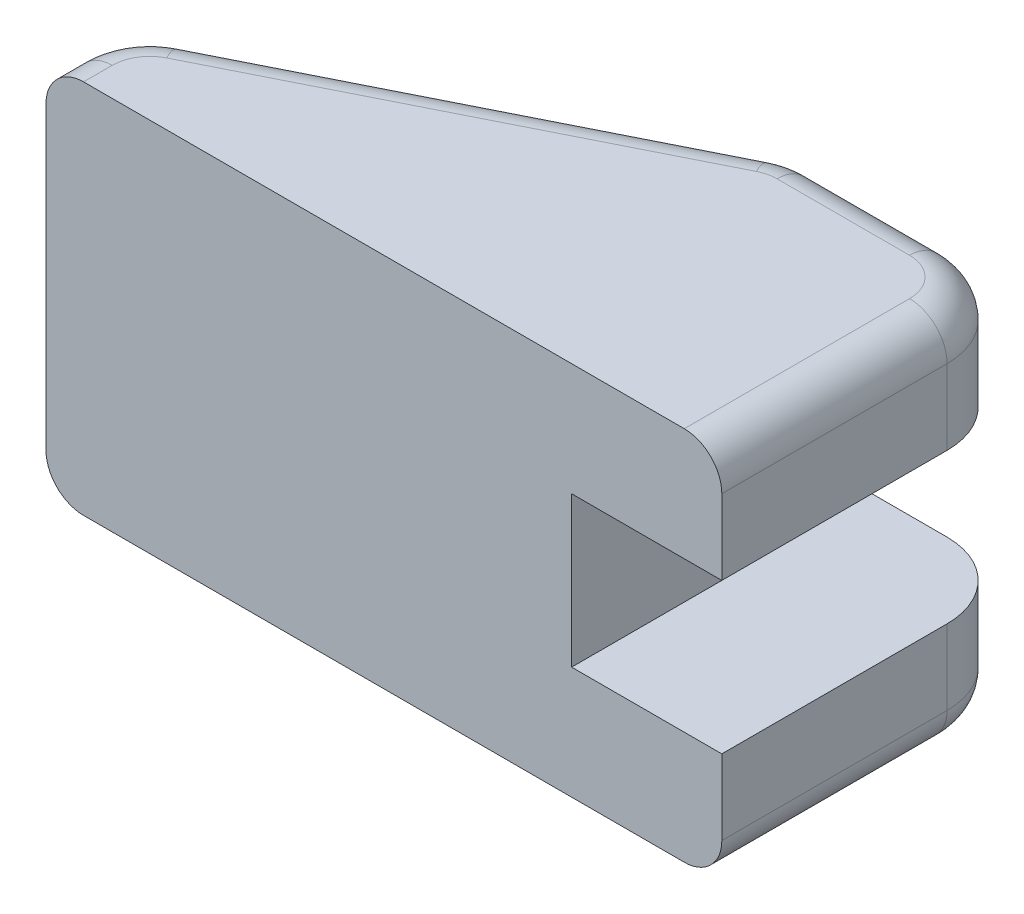
ISO-10303-21;
HEADER;
FILE_DESCRIPTION(('STEP AP214'),'2;1');
FILE_NAME('part.step','',(''),(''),'','','');
FILE_SCHEMA(('AUTOMOTIVE_DESIGN { 1 0 10303 214 1 1 1 1 }'));
ENDSEC;
DATA;
#1=APPLICATION_CONTEXT('core data for automotive mechanical design processes');
#2=APPLICATION_PROTOCOL_DEFINITION('international standard','automotive_design',2000,#1);
#3=PRODUCT_CONTEXT('',#1,'mechanical');
#4=PRODUCT('Part','Part','',(#3));
#5=PRODUCT_RELATED_PRODUCT_CATEGORY('part','',(#4));
#6=PRODUCT_DEFINITION_FORMATION('','',#4);
#7=PRODUCT_DEFINITION_CONTEXT('part definition',#1,'design');
#8=PRODUCT_DEFINITION('design','',#6,#7);
#9=PRODUCT_DEFINITION_SHAPE('','',#8);
#10=(LENGTH_UNIT() NAMED_UNIT(*) SI_UNIT(.MILLI.,.METRE.));
#11=(NAMED_UNIT(*) PLANE_ANGLE_UNIT() SI_UNIT($,.RADIAN.));
#12=(NAMED_UNIT(*) SI_UNIT($,.STERADIAN.) SOLID_ANGLE_UNIT());
#13=UNCERTAINTY_MEASURE_WITH_UNIT(LENGTH_MEASURE(1.E-05),#10,'distance_accuracy_value','');
#14=(GEOMETRIC_REPRESENTATION_CONTEXT(3) GLOBAL_UNCERTAINTY_ASSIGNED_CONTEXT((#13)) GLOBAL_UNIT_ASSIGNED_CONTEXT((#10,
#11,#12)) REPRESENTATION_CONTEXT('',''));
#15=CARTESIAN_POINT('',(0.,0.,0.));
#16=DIRECTION('',(0.,0.,1.));
#17=DIRECTION('',(1.,0.,0.));
#18=AXIS2_PLACEMENT_3D('',#15,#16,#17);
#19=CARTESIAN_POINT('',(-652.,0.,-40.));
#20=DIRECTION('',(-1.,0.,0.));
#21=DIRECTION('',(0.,0.,1.));
#22=AXIS2_PLACEMENT_3D('',#19,#20,#21);
#23=PLANE('',#22);
#24=DIRECTION('',(0.,-1.,0.));
#25=VECTOR('',#24,1.);
#26=CARTESIAN_POINT('',(-652.,0.,-3.81966011250102));
#27=LINE('',#26,#25);
#28=CARTESIAN_POINT('',(-652.,420.,-3.81966011250102));
#29=VERTEX_POINT('',#28);
#30=CARTESIAN_POINT('',(-652.,380.,-3.81966011250102));
#31=VERTEX_POINT('',#30);
#32=EDGE_CURVE('E251',#29,#31,#27,.T.);
#33=ORIENTED_EDGE('',*,*,#32,.T.);
#34=DIRECTION('',(0.,0.,1.));
#35=VECTOR('',#34,1.);
#36=CARTESIAN_POINT('',(-652.,380.,0.));
#37=LINE('',#36,#35);
#38=CARTESIAN_POINT('',(-652.,380.,0.));
#39=VERTEX_POINT('',#38);
#40=EDGE_CURVE('E267',#31,#39,#37,.T.);
#41=ORIENTED_EDGE('',*,*,#40,.T.);
#42=DIRECTION('',(0.,-1.,0.));
#43=VECTOR('',#42,1.);
#44=CARTESIAN_POINT('',(-652.,0.,0.));
#45=LINE('',#44,#43);
#46=CARTESIAN_POINT('',(-652.,420.,0.));
#47=VERTEX_POINT('',#46);
#48=EDGE_CURVE('E216',#47,#39,#45,.T.);
#49=ORIENTED_EDGE('',*,*,#48,.F.);
#50=DIRECTION('',(0.,0.,1.));
#51=VECTOR('',#50,1.);
#52=CARTESIAN_POINT('',(-652.,420.,-40.));
#53=LINE('',#52,#51);
#54=EDGE_CURVE('E265',#47,#29,#53,.F.);
#55=ORIENTED_EDGE('',*,*,#54,.T.);
#56=EDGE_LOOP('',(#33,#41,#49,#55));
#57=FACE_BOUND('',#56,.T.);
#58=ADVANCED_FACE('F42',(#57),#23,.T.);
#59=CARTESIAN_POINT('',(0.,425.,-40.));
#60=DIRECTION('',(0.,1.,0.));
#61=DIRECTION('',(0.,0.,1.));
#62=AXIS2_PLACEMENT_3D('',#59,#60,#61);
#63=PLANE('',#62);
#64=DIRECTION('',(-1.,0.,0.));
#65=VECTOR('',#64,1.);
#66=CARTESIAN_POINT('',(0.,425.,0.));
#67=LINE('',#66,#65);
#68=CARTESIAN_POINT('',(-567.,425.,0.));
#69=VERTEX_POINT('',#68);
#70=CARTESIAN_POINT('',(-647.,425.,0.));
#71=VERTEX_POINT('',#70);
#72=EDGE_CURVE('E207',#69,#71,#67,.T.);
#73=ORIENTED_EDGE('',*,*,#72,.F.);
#74=DIRECTION('',(0.,0.,1.));
#75=VECTOR('',#74,1.);
#76=CARTESIAN_POINT('',(-567.,425.,-40.));
#77=LINE('',#76,#75);
#78=CARTESIAN_POINT('',(-567.,425.,-30.));
#79=VERTEX_POINT('',#78);
#80=EDGE_CURVE('E59',#69,#79,#77,.F.);
#81=ORIENTED_EDGE('',*,*,#80,.T.);
#82=CARTESIAN_POINT('',(-572.,425.,-30.));
#83=DIRECTION('',(0.,1.,0.));
#84=DIRECTION('',(0.,0.,1.));
#85=AXIS2_PLACEMENT_3D('',#82,#83,#84);
#86=CIRCLE('',#85,5.);
#87=CARTESIAN_POINT('',(-572.,425.,-35.));
#88=VERTEX_POINT('',#87);
#89=EDGE_CURVE('E63',#79,#88,#86,.T.);
#90=ORIENTED_EDGE('',*,*,#89,.T.);
#91=DIRECTION('',(-1.,0.,0.));
#92=VECTOR('',#91,1.);
#93=CARTESIAN_POINT('',(-589.639320225002,425.,-35.));
#94=LINE('',#93,#92);
#95=CARTESIAN_POINT('',(-589.639320225002,425.,-35.));
#96=VERTEX_POINT('',#95);
#97=EDGE_CURVE('E319',#88,#96,#94,.T.);
#98=ORIENTED_EDGE('',*,*,#97,.T.);
#99=CARTESIAN_POINT('',(-589.639320225002,425.,-30.));
#100=DIRECTION('',(0.,1.,0.));
#101=DIRECTION('',(0.,0.,1.));
#102=AXIS2_PLACEMENT_3D('',#99,#100,#101);
#103=CIRCLE('',#102,5.);
#104=CARTESIAN_POINT('',(-591.875388202502,425.,-34.4721359549996));
#105=VERTEX_POINT('',#104);
#106=EDGE_CURVE('E317',#96,#105,#103,.T.);
#107=ORIENTED_EDGE('',*,*,#106,.T.);
#108=DIRECTION('',(-0.894427190999917,0.,0.447213595499956));
#109=VECTOR('',#108,1.);
#110=CARTESIAN_POINT('',(-116.163932022499,425.,-272.327864045));
#111=LINE('',#110,#109);
#112=CARTESIAN_POINT('',(-644.2360679775,425.,-8.29179606750059));
#113=VERTEX_POINT('',#112);
#114=EDGE_CURVE('E311',#105,#113,#111,.T.);
#115=ORIENTED_EDGE('',*,*,#114,.T.);
#116=CARTESIAN_POINT('',(-642.,425.,-3.81966011250102));
#117=DIRECTION('',(0.,1.,0.));
#118=DIRECTION('',(0.,0.,1.));
#119=AXIS2_PLACEMENT_3D('',#116,#117,#118);
#120=CIRCLE('',#119,5.);
#121=CARTESIAN_POINT('',(-647.,425.,-3.81966011250102));
#122=VERTEX_POINT('',#121);
#123=EDGE_CURVE('E313',#113,#122,#120,.T.);
#124=ORIENTED_EDGE('',*,*,#123,.T.);
#125=DIRECTION('',(0.,0.,1.));
#126=VECTOR('',#125,1.);
#127=CARTESIAN_POINT('',(-647.,425.,-40.));
#128=LINE('',#127,#126);
#129=EDGE_CURVE('E315',#122,#71,#128,.T.);
#130=ORIENTED_EDGE('',*,*,#129,.T.);
#131=EDGE_LOOP('',(#73,#81,#90,#98,#107,#115,#124,#130));
#132=FACE_BOUND('',#131,.T.);
#133=ADVANCED_FACE('F370',(#132),#63,.T.);
#134=CARTESIAN_POINT('',(-562.,0.,-40.));
#135=DIRECTION('',(1.,0.,0.));
#136=DIRECTION('',(0.,0.,-1.));
#137=AXIS2_PLACEMENT_3D('',#134,#135,#136);
#138=PLANE('',#137);
#139=DIRECTION('',(0.,1.,0.));
#140=VECTOR('',#139,1.);
#141=CARTESIAN_POINT('',(-562.,425.,-30.));
#142=LINE('',#141,#140);
#143=CARTESIAN_POINT('',(-562.,410.,-30.));
#144=VERTEX_POINT('',#143);
#145=CARTESIAN_POINT('',(-562.,420.,-30.));
#146=VERTEX_POINT('',#145);
#147=EDGE_CURVE('E260',#144,#146,#142,.T.);
#148=ORIENTED_EDGE('',*,*,#147,.T.);
#149=DIRECTION('',(0.,0.,1.));
#150=VECTOR('',#149,1.);
#151=CARTESIAN_POINT('',(-562.,420.,-40.));
#152=LINE('',#151,#150);
#153=CARTESIAN_POINT('',(-562.,420.,0.));
#154=VERTEX_POINT('',#153);
#155=EDGE_CURVE('E308',#146,#154,#152,.T.);
#156=ORIENTED_EDGE('',*,*,#155,.T.);
#157=DIRECTION('',(0.,1.,0.));
#158=VECTOR('',#157,1.);
#159=CARTESIAN_POINT('',(-562.,0.,0.));
#160=LINE('',#159,#158);
#161=CARTESIAN_POINT('',(-562.,410.,0.));
#162=VERTEX_POINT('',#161);
#163=EDGE_CURVE('E232',#162,#154,#160,.T.);
#164=ORIENTED_EDGE('',*,*,#163,.F.);
#165=DIRECTION('',(0.,0.,1.));
#166=VECTOR('',#165,1.);
#167=CARTESIAN_POINT('',(-562.,410.,-40.));
#168=LINE('',#167,#166);
#169=EDGE_CURVE('E237',#144,#162,#168,.T.);
#170=ORIENTED_EDGE('',*,*,#169,.F.);
#171=EDGE_LOOP('',(#148,#156,#164,#170));
#172=FACE_BOUND('',#171,.T.);
#173=ADVANCED_FACE('F379',(#172),#138,.T.);
#174=CARTESIAN_POINT('',(0.,410.,-40.));
#175=DIRECTION('',(0.,-1.,0.));
#176=DIRECTION('',(0.,0.,-1.));
#177=AXIS2_PLACEMENT_3D('',#174,#175,#176);
#178=PLANE('',#177);
#179=DIRECTION('',(1.,0.,0.));
#180=VECTOR('',#179,1.);
#181=CARTESIAN_POINT('',(0.,410.,-40.));
#182=LINE('',#181,#180);
#183=CARTESIAN_POINT('',(-582.,410.,-40.));
#184=VERTEX_POINT('',#183);
#185=CARTESIAN_POINT('',(-572.,410.,-40.));
#186=VERTEX_POINT('',#185);
#187=EDGE_CURVE('E212',#184,#186,#182,.T.);
#188=ORIENTED_EDGE('',*,*,#187,.T.);
#189=CARTESIAN_POINT('',(-572.,410.,-30.));
#190=DIRECTION('',(0.,-1.,0.));
#191=DIRECTION('',(0.,0.,-1.));
#192=AXIS2_PLACEMENT_3D('',#189,#190,#191);
#193=CIRCLE('',#192,10.);
#194=EDGE_CURVE('E263',#186,#144,#193,.T.);
#195=ORIENTED_EDGE('',*,*,#194,.T.);
#196=ORIENTED_EDGE('',*,*,#169,.T.);
#197=DIRECTION('',(1.,0.,0.));
#198=VECTOR('',#197,1.);
#199=CARTESIAN_POINT('',(0.,410.,0.));
#200=LINE('',#199,#198);
#201=CARTESIAN_POINT('',(-582.,410.,0.));
#202=VERTEX_POINT('',#201);
#203=EDGE_CURVE('E229',#202,#162,#200,.T.);
#204=ORIENTED_EDGE('',*,*,#203,.F.);
#205=DIRECTION('',(0.,0.,1.));
#206=VECTOR('',#205,1.);
#207=CARTESIAN_POINT('',(-582.,410.,-40.));
#208=LINE('',#207,#206);
#209=EDGE_CURVE('E195',#184,#202,#208,.T.);
#210=ORIENTED_EDGE('',*,*,#209,.F.);
#211=EDGE_LOOP('',(#188,#195,#196,#204,#210));
#212=FACE_BOUND('',#211,.T.);
#213=ADVANCED_FACE('F599',(#212),#178,.T.);
#214=CARTESIAN_POINT('',(-582.,0.,-40.));
#215=DIRECTION('',(1.,0.,0.));
#216=DIRECTION('',(0.,0.,-1.));
#217=AXIS2_PLACEMENT_3D('',#214,#215,#216);
#218=PLANE('',#217);
#219=DIRECTION('',(0.,1.,0.));
#220=VECTOR('',#219,1.);
#221=CARTESIAN_POINT('',(-582.,0.,0.));
#222=LINE('',#221,#220);
#223=CARTESIAN_POINT('',(-582.,390.,0.));
#224=VERTEX_POINT('',#223);
#225=EDGE_CURVE('E191',#224,#202,#222,.T.);
#226=ORIENTED_EDGE('',*,*,#225,.F.);
#227=DIRECTION('',(0.,0.,1.));
#228=VECTOR('',#227,1.);
#229=CARTESIAN_POINT('',(-582.,390.,-40.));
#230=LINE('',#229,#228);
#231=CARTESIAN_POINT('',(-582.,390.,-40.));
#232=VERTEX_POINT('',#231);
#233=EDGE_CURVE('E185',#232,#224,#230,.T.);
#234=ORIENTED_EDGE('',*,*,#233,.F.);
#235=DIRECTION('',(0.,1.,0.));
#236=VECTOR('',#235,1.);
#237=CARTESIAN_POINT('',(-582.,0.,-40.));
#238=LINE('',#237,#236);
#239=EDGE_CURVE('E189',#232,#184,#238,.T.);
#240=ORIENTED_EDGE('',*,*,#239,.T.);
#241=ORIENTED_EDGE('',*,*,#209,.T.);
#242=EDGE_LOOP('',(#226,#234,#240,#241));
#243=FACE_BOUND('',#242,.T.);
#244=ADVANCED_FACE('F187',(#243),#218,.T.);
#245=CARTESIAN_POINT('',(0.,390.,-40.));
#246=DIRECTION('',(0.,-1.,0.));
#247=DIRECTION('',(0.,0.,-1.));
#248=AXIS2_PLACEMENT_3D('',#245,#246,#247);
#249=PLANE('',#248);
#250=DIRECTION('',(0.,0.,1.));
#251=VECTOR('',#250,1.);
#252=CARTESIAN_POINT('',(-562.,390.,-40.));
#253=LINE('',#252,#251);
#254=CARTESIAN_POINT('',(-562.,390.,-30.));
#255=VERTEX_POINT('',#254);
#256=CARTESIAN_POINT('',(-562.,390.,0.));
#257=VERTEX_POINT('',#256);
#258=EDGE_CURVE('E196',#255,#257,#253,.T.);
#259=ORIENTED_EDGE('',*,*,#258,.F.);
#260=CARTESIAN_POINT('',(-572.,390.,-30.));
#261=DIRECTION('',(0.,-1.,0.));
#262=DIRECTION('',(0.,0.,-1.));
#263=AXIS2_PLACEMENT_3D('',#260,#261,#262);
#264=CIRCLE('',#263,10.);
#265=CARTESIAN_POINT('',(-572.,390.,-40.));
#266=VERTEX_POINT('',#265);
#267=EDGE_CURVE('E203',#255,#266,#264,.F.);
#268=ORIENTED_EDGE('',*,*,#267,.T.);
#269=DIRECTION('',(1.,0.,0.));
#270=VECTOR('',#269,1.);
#271=CARTESIAN_POINT('',(0.,390.,-40.));
#272=LINE('',#271,#270);
#273=EDGE_CURVE('E199',#232,#266,#272,.T.);
#274=ORIENTED_EDGE('',*,*,#273,.F.);
#275=ORIENTED_EDGE('',*,*,#233,.T.);
#276=DIRECTION('',(1.,0.,0.));
#277=VECTOR('',#276,1.);
#278=CARTESIAN_POINT('',(0.,390.,0.));
#279=LINE('',#278,#277);
#280=EDGE_CURVE('E226',#224,#257,#279,.T.);
#281=ORIENTED_EDGE('',*,*,#280,.T.);
#282=EDGE_LOOP('',(#259,#268,#274,#275,#281));
#283=FACE_BOUND('',#282,.T.);
#284=ADVANCED_FACE('F201',(#283),#249,.F.);
#285=CARTESIAN_POINT('',(-562.,0.,-40.));
#286=DIRECTION('',(-1.,0.,0.));
#287=DIRECTION('',(0.,0.,1.));
#288=AXIS2_PLACEMENT_3D('',#285,#286,#287);
#289=PLANE('',#288);
#290=DIRECTION('',(0.,-1.,0.));
#291=VECTOR('',#290,1.);
#292=CARTESIAN_POINT('',(-562.,0.,0.));
#293=LINE('',#292,#291);
#294=CARTESIAN_POINT('',(-562.,380.,0.));
#295=VERTEX_POINT('',#294);
#296=EDGE_CURVE('E223',#257,#295,#293,.T.);
#297=ORIENTED_EDGE('',*,*,#296,.T.);
#298=DIRECTION('',(0.,0.,1.));
#299=VECTOR('',#298,1.);
#300=CARTESIAN_POINT('',(-562.,380.,-40.));
#301=LINE('',#300,#299);
#302=CARTESIAN_POINT('',(-562.,380.,-30.));
#303=VERTEX_POINT('',#302);
#304=EDGE_CURVE('E296',#295,#303,#301,.F.);
#305=ORIENTED_EDGE('',*,*,#304,.T.);
#306=DIRECTION('',(0.,-1.,0.));
#307=VECTOR('',#306,1.);
#308=CARTESIAN_POINT('',(-562.,0.,-30.));
#309=LINE('',#308,#307);
#310=EDGE_CURVE('E248',#303,#255,#309,.F.);
#311=ORIENTED_EDGE('',*,*,#310,.T.);
#312=ORIENTED_EDGE('',*,*,#258,.T.);
#313=EDGE_LOOP('',(#297,#305,#311,#312));
#314=FACE_BOUND('',#313,.T.);
#315=ADVANCED_FACE('F584',(#314),#289,.F.);
#316=CARTESIAN_POINT('',(0.,375.,-40.));
#317=DIRECTION('',(0.,1.,0.));
#318=DIRECTION('',(0.,0.,1.));
#319=AXIS2_PLACEMENT_3D('',#316,#317,#318);
#320=PLANE('',#319);
#321=DIRECTION('',(-1.,0.,0.));
#322=VECTOR('',#321,1.);
#323=CARTESIAN_POINT('',(0.,375.,0.));
#324=LINE('',#323,#322);
#325=CARTESIAN_POINT('',(-567.,375.,0.));
#326=VERTEX_POINT('',#325);
#327=CARTESIAN_POINT('',(-647.,375.,0.));
#328=VERTEX_POINT('',#327);
#329=EDGE_CURVE('E219',#326,#328,#324,.T.);
#330=ORIENTED_EDGE('',*,*,#329,.T.);
#331=DIRECTION('',(0.,0.,1.));
#332=VECTOR('',#331,1.);
#333=CARTESIAN_POINT('',(-647.,375.,-3.81966011250102));
#334=LINE('',#333,#332);
#335=CARTESIAN_POINT('',(-647.,375.,-3.81966011250102));
#336=VERTEX_POINT('',#335);
#337=EDGE_CURVE('E290',#328,#336,#334,.F.);
#338=ORIENTED_EDGE('',*,*,#337,.T.);
#339=CARTESIAN_POINT('',(-642.,375.,-3.81966011250102));
#340=DIRECTION('',(0.,1.,0.));
#341=DIRECTION('',(0.,0.,1.));
#342=AXIS2_PLACEMENT_3D('',#339,#340,#341);
#343=CIRCLE('',#342,5.);
#344=CARTESIAN_POINT('',(-644.2360679775,375.,-8.2917960675006));
#345=VERTEX_POINT('',#344);
#346=EDGE_CURVE('E288',#336,#345,#343,.F.);
#347=ORIENTED_EDGE('',*,*,#346,.T.);
#348=DIRECTION('',(0.894427190999917,0.,-0.447213595499956));
#349=VECTOR('',#348,1.);
#350=CARTESIAN_POINT('',(-591.875388202502,375.,-34.4721359549995));
#351=LINE('',#350,#349);
#352=CARTESIAN_POINT('',(-591.875388202502,375.,-34.4721359549996));
#353=VERTEX_POINT('',#352);
#354=EDGE_CURVE('E278',#345,#353,#351,.T.);
#355=ORIENTED_EDGE('',*,*,#354,.T.);
#356=CARTESIAN_POINT('',(-589.639320225002,375.,-30.));
#357=DIRECTION('',(0.,1.,0.));
#358=DIRECTION('',(0.,0.,1.));
#359=AXIS2_PLACEMENT_3D('',#356,#357,#358);
#360=CIRCLE('',#359,5.);
#361=CARTESIAN_POINT('',(-589.639320225002,375.,-35.));
#362=VERTEX_POINT('',#361);
#363=EDGE_CURVE('E280',#353,#362,#360,.F.);
#364=ORIENTED_EDGE('',*,*,#363,.T.);
#365=DIRECTION('',(-1.,0.,0.));
#366=VECTOR('',#365,1.);
#367=CARTESIAN_POINT('',(0.,375.,-35.));
#368=LINE('',#367,#366);
#369=CARTESIAN_POINT('',(-572.,375.,-35.));
#370=VERTEX_POINT('',#369);
#371=EDGE_CURVE('E282',#362,#370,#368,.F.);
#372=ORIENTED_EDGE('',*,*,#371,.T.);
#373=CARTESIAN_POINT('',(-572.,375.,-30.));
#374=DIRECTION('',(0.,1.,0.));
#375=DIRECTION('',(0.,0.,1.));
#376=AXIS2_PLACEMENT_3D('',#373,#374,#375);
#377=CIRCLE('',#376,5.);
#378=CARTESIAN_POINT('',(-567.,375.,-30.));
#379=VERTEX_POINT('',#378);
#380=EDGE_CURVE('E284',#370,#379,#377,.F.);
#381=ORIENTED_EDGE('',*,*,#380,.T.);
#382=DIRECTION('',(0.,0.,1.));
#383=VECTOR('',#382,1.);
#384=CARTESIAN_POINT('',(-567.,375.,-40.));
#385=LINE('',#384,#383);
#386=EDGE_CURVE('E286',#379,#326,#385,.T.);
#387=ORIENTED_EDGE('',*,*,#386,.T.);
#388=EDGE_LOOP('',(#330,#338,#347,#355,#364,#372,#381,#387));
#389=FACE_BOUND('',#388,.T.);
#390=ADVANCED_FACE('F433',(#389),#320,.F.);
#391=CARTESIAN_POINT('',(0.,0.,-40.));
#392=DIRECTION('',(0.,0.,1.));
#393=DIRECTION('',(1.,0.,0.));
#394=AXIS2_PLACEMENT_3D('',#391,#392,#393);
#395=PLANE('',#394);
#396=DIRECTION('',(0.,-1.,0.));
#397=VECTOR('',#396,1.);
#398=CARTESIAN_POINT('',(-572.,0.,-40.));
#399=LINE('',#398,#397);
#400=CARTESIAN_POINT('',(-572.,380.,-40.));
#401=VERTEX_POINT('',#400);
#402=EDGE_CURVE('E246',#266,#401,#399,.T.);
#403=ORIENTED_EDGE('',*,*,#402,.T.);
#404=DIRECTION('',(-1.,0.,0.));
#405=VECTOR('',#404,1.);
#406=CARTESIAN_POINT('',(0.,380.,-40.));
#407=LINE('',#406,#405);
#408=CARTESIAN_POINT('',(-589.639320225002,380.,-40.));
#409=VERTEX_POINT('',#408);
#410=EDGE_CURVE('E302',#401,#409,#407,.T.);
#411=ORIENTED_EDGE('',*,*,#410,.T.);
#412=DIRECTION('',(0.,1.,0.));
#413=VECTOR('',#412,1.);
#414=CARTESIAN_POINT('',(-589.639320225002,425.,-40.));
#415=LINE('',#414,#413);
#416=CARTESIAN_POINT('',(-589.639320225002,420.,-40.));
#417=VERTEX_POINT('',#416);
#418=EDGE_CURVE('E243',#409,#417,#415,.T.);
#419=ORIENTED_EDGE('',*,*,#418,.T.);
#420=DIRECTION('',(-1.,0.,0.));
#421=VECTOR('',#420,1.);
#422=CARTESIAN_POINT('',(-572.,420.,-40.));
#423=LINE('',#422,#421);
#424=CARTESIAN_POINT('',(-572.,420.,-40.));
#425=VERTEX_POINT('',#424);
#426=EDGE_CURVE('E300',#417,#425,#423,.F.);
#427=ORIENTED_EDGE('',*,*,#426,.T.);
#428=DIRECTION('',(0.,1.,0.));
#429=VECTOR('',#428,1.);
#430=CARTESIAN_POINT('',(-572.,410.,-40.));
#431=LINE('',#430,#429);
#432=EDGE_CURVE('E239',#425,#186,#431,.F.);
#433=ORIENTED_EDGE('',*,*,#432,.T.);
#434=ORIENTED_EDGE('',*,*,#187,.F.);
#435=ORIENTED_EDGE('',*,*,#239,.F.);
#436=ORIENTED_EDGE('',*,*,#273,.T.);
#437=EDGE_LOOP('',(#403,#411,#419,#427,#433,#434,#435,#436));
#438=FACE_BOUND('',#437,.T.);
#439=ADVANCED_FACE('F210',(#438),#395,.F.);
#440=CARTESIAN_POINT('',(0.,0.,0.));
#441=DIRECTION('',(0.,0.,1.));
#442=DIRECTION('',(1.,0.,0.));
#443=AXIS2_PLACEMENT_3D('',#440,#441,#442);
#444=PLANE('',#443);
#445=ORIENTED_EDGE('',*,*,#48,.T.);
#446=CARTESIAN_POINT('',(-647.,380.,0.));
#447=DIRECTION('',(0.,0.,1.));
#448=DIRECTION('',(1.,0.,0.));
#449=AXIS2_PLACEMENT_3D('',#446,#447,#448);
#450=CIRCLE('',#449,5.);
#451=EDGE_CURVE('E276',#39,#328,#450,.T.);
#452=ORIENTED_EDGE('',*,*,#451,.T.);
#453=ORIENTED_EDGE('',*,*,#329,.F.);
#454=CARTESIAN_POINT('',(-567.,380.,0.));
#455=DIRECTION('',(0.,0.,1.));
#456=DIRECTION('',(1.,0.,0.));
#457=AXIS2_PLACEMENT_3D('',#454,#455,#456);
#458=CIRCLE('',#457,5.);
#459=EDGE_CURVE('E274',#326,#295,#458,.T.);
#460=ORIENTED_EDGE('',*,*,#459,.T.);
#461=ORIENTED_EDGE('',*,*,#296,.F.);
#462=ORIENTED_EDGE('',*,*,#280,.F.);
#463=ORIENTED_EDGE('',*,*,#225,.T.);
#464=ORIENTED_EDGE('',*,*,#203,.T.);
#465=ORIENTED_EDGE('',*,*,#163,.T.);
#466=CARTESIAN_POINT('',(-567.,420.,0.));
#467=DIRECTION('',(0.,0.,1.));
#468=DIRECTION('',(1.,0.,0.));
#469=AXIS2_PLACEMENT_3D('',#466,#467,#468);
#470=CIRCLE('',#469,5.);
#471=EDGE_CURVE('E272',#154,#69,#470,.T.);
#472=ORIENTED_EDGE('',*,*,#471,.T.);
#473=ORIENTED_EDGE('',*,*,#72,.T.);
#474=CARTESIAN_POINT('',(-647.,420.,0.));
#475=DIRECTION('',(0.,0.,1.));
#476=DIRECTION('',(1.,0.,0.));
#477=AXIS2_PLACEMENT_3D('',#474,#475,#476);
#478=CIRCLE('',#477,5.);
#479=EDGE_CURVE('E270',#71,#47,#478,.T.);
#480=ORIENTED_EDGE('',*,*,#479,.T.);
#481=EDGE_LOOP('',(#445,#452,#453,#460,#461,#462,#463,#464,#465,#472,#473,#480));
#482=FACE_BOUND('',#481,.T.);
#483=ADVANCED_FACE('F372',(#482),#444,.T.);
#484=CARTESIAN_POINT('',(-652.,0.,-9.99999999999995));
#485=DIRECTION('',(-0.447213595499956,0.,-0.894427190999917));
#486=DIRECTION('',(0.,1.,0.));
#487=AXIS2_PLACEMENT_3D('',#484,#485,#486);
#488=PLANE('',#487);
#489=DIRECTION('',(0.,1.,0.));
#490=VECTOR('',#489,1.);
#491=CARTESIAN_POINT('',(-594.111456180001,375.,-38.9442719099992));
#492=LINE('',#491,#490);
#493=CARTESIAN_POINT('',(-594.111456180001,420.,-38.9442719099992));
#494=VERTEX_POINT('',#493);
#495=CARTESIAN_POINT('',(-594.111456180001,380.,-38.9442719099992));
#496=VERTEX_POINT('',#495);
#497=EDGE_CURVE('E254',#494,#496,#492,.F.);
#498=ORIENTED_EDGE('',*,*,#497,.T.);
#499=DIRECTION('',(0.894427190999917,0.,-0.447213595499956));
#500=VECTOR('',#499,1.);
#501=CARTESIAN_POINT('',(-646.472135955,380.,-12.7639320225001));
#502=LINE('',#501,#500);
#503=CARTESIAN_POINT('',(-646.472135955,380.,-12.7639320225002));
#504=VERTEX_POINT('',#503);
#505=EDGE_CURVE('E11',#496,#504,#502,.F.);
#506=ORIENTED_EDGE('',*,*,#505,.T.);
#507=DIRECTION('',(0.,-1.,0.));
#508=VECTOR('',#507,1.);
#509=CARTESIAN_POINT('',(-646.472135955,0.,-12.7639320225002));
#510=LINE('',#509,#508);
#511=CARTESIAN_POINT('',(-646.472135955,420.,-12.7639320225002));
#512=VERTEX_POINT('',#511);
#513=EDGE_CURVE('E257',#504,#512,#510,.F.);
#514=ORIENTED_EDGE('',*,*,#513,.T.);
#515=DIRECTION('',(-0.894427190999917,0.,0.447213595499956));
#516=VECTOR('',#515,1.);
#517=CARTESIAN_POINT('',(-652.,420.,-9.99999999999995));
#518=LINE('',#517,#516);
#519=EDGE_CURVE('E51',#512,#494,#518,.F.);
#520=ORIENTED_EDGE('',*,*,#519,.T.);
#521=EDGE_LOOP('',(#498,#506,#514,#520));
#522=FACE_BOUND('',#521,.T.);
#523=ADVANCED_FACE('F401',(#522),#488,.T.);
#524=CARTESIAN_POINT('',(-572.,0.,-30.));
#525=DIRECTION('',(0.,-1.,0.));
#526=DIRECTION('',(0.,0.,-1.));
#527=AXIS2_PLACEMENT_3D('',#524,#525,#526);
#528=CYLINDRICAL_SURFACE('',#527,10.);
#529=ORIENTED_EDGE('',*,*,#310,.F.);
#530=CARTESIAN_POINT('',(-572.,380.,-30.));
#531=DIRECTION('',(0.,1.,0.));
#532=DIRECTION('',(0.,0.,1.));
#533=AXIS2_PLACEMENT_3D('',#530,#531,#532);
#534=CIRCLE('',#533,10.);
#535=EDGE_CURVE('E298',#303,#401,#534,.T.);
#536=ORIENTED_EDGE('',*,*,#535,.T.);
#537=ORIENTED_EDGE('',*,*,#402,.F.);
#538=ORIENTED_EDGE('',*,*,#267,.F.);
#539=EDGE_LOOP('',(#529,#536,#537,#538));
#540=FACE_BOUND('',#539,.T.);
#541=ADVANCED_FACE('F447',(#540),#528,.T.);
#542=CARTESIAN_POINT('',(-642.,0.,-3.81966011250102));
#543=DIRECTION('',(0.,-1.,0.));
#544=DIRECTION('',(0.,0.,-1.));
#545=AXIS2_PLACEMENT_3D('',#542,#543,#544);
#546=CYLINDRICAL_SURFACE('',#545,10.);
#547=ORIENTED_EDGE('',*,*,#513,.F.);
#548=CARTESIAN_POINT('',(-642.,380.,-3.81966011250102));
#549=DIRECTION('',(0.,1.,0.));
#550=DIRECTION('',(0.,0.,1.));
#551=AXIS2_PLACEMENT_3D('',#548,#549,#550);
#552=CIRCLE('',#551,10.);
#553=EDGE_CURVE('E294',#504,#31,#552,.T.);
#554=ORIENTED_EDGE('',*,*,#553,.T.);
#555=ORIENTED_EDGE('',*,*,#32,.F.);
#556=CARTESIAN_POINT('',(-642.,420.,-3.81966011250102));
#557=DIRECTION('',(0.,1.,0.));
#558=DIRECTION('',(0.,0.,1.));
#559=AXIS2_PLACEMENT_3D('',#556,#557,#558);
#560=CIRCLE('',#559,10.);
#561=EDGE_CURVE('E292',#29,#512,#560,.F.);
#562=ORIENTED_EDGE('',*,*,#561,.T.);
#563=EDGE_LOOP('',(#547,#554,#555,#562));
#564=FACE_BOUND('',#563,.T.);
#565=ADVANCED_FACE('F419',(#564),#546,.T.);
#566=CARTESIAN_POINT('',(-589.639320225002,0.,-30.));
#567=DIRECTION('',(0.,-1.,0.));
#568=DIRECTION('',(0.,0.,-1.));
#569=AXIS2_PLACEMENT_3D('',#566,#567,#568);
#570=CYLINDRICAL_SURFACE('',#569,10.);
#571=ORIENTED_EDGE('',*,*,#418,.F.);
#572=CARTESIAN_POINT('',(-589.639320225002,380.,-30.));
#573=DIRECTION('',(0.,1.,0.));
#574=DIRECTION('',(0.,0.,1.));
#575=AXIS2_PLACEMENT_3D('',#572,#573,#574);
#576=CIRCLE('',#575,10.);
#577=EDGE_CURVE('E306',#409,#496,#576,.T.);
#578=ORIENTED_EDGE('',*,*,#577,.T.);
#579=ORIENTED_EDGE('',*,*,#497,.F.);
#580=CARTESIAN_POINT('',(-589.639320225002,420.,-30.));
#581=DIRECTION('',(0.,1.,0.));
#582=DIRECTION('',(0.,0.,1.));
#583=AXIS2_PLACEMENT_3D('',#580,#581,#582);
#584=CIRCLE('',#583,10.);
#585=EDGE_CURVE('E304',#494,#417,#584,.F.);
#586=ORIENTED_EDGE('',*,*,#585,.T.);
#587=EDGE_LOOP('',(#571,#578,#579,#586));
#588=FACE_BOUND('',#587,.T.);
#589=ADVANCED_FACE('F406',(#588),#570,.T.);
#590=CARTESIAN_POINT('',(-572.,0.,-30.));
#591=DIRECTION('',(0.,-1.,0.));
#592=DIRECTION('',(0.,0.,-1.));
#593=AXIS2_PLACEMENT_3D('',#590,#591,#592);
#594=CYLINDRICAL_SURFACE('',#593,10.);
#595=ORIENTED_EDGE('',*,*,#432,.F.);
#596=CARTESIAN_POINT('',(-572.,420.,-30.));
#597=DIRECTION('',(0.,1.,0.));
#598=DIRECTION('',(0.,0.,1.));
#599=AXIS2_PLACEMENT_3D('',#596,#597,#598);
#600=CIRCLE('',#599,10.);
#601=EDGE_CURVE('E323',#425,#146,#600,.F.);
#602=ORIENTED_EDGE('',*,*,#601,.T.);
#603=ORIENTED_EDGE('',*,*,#147,.F.);
#604=ORIENTED_EDGE('',*,*,#194,.F.);
#605=EDGE_LOOP('',(#595,#602,#603,#604));
#606=FACE_BOUND('',#605,.T.);
#607=ADVANCED_FACE('F479',(#606),#594,.T.);
#608=CARTESIAN_POINT('',(-567.,380.,-40.));
#609=DIRECTION('',(0.,0.,1.));
#610=DIRECTION('',(1.,0.,0.));
#611=AXIS2_PLACEMENT_3D('',#608,#609,#610);
#612=CYLINDRICAL_SURFACE('',#611,5.);
#613=ORIENTED_EDGE('',*,*,#459,.F.);
#614=ORIENTED_EDGE('',*,*,#386,.F.);
#615=CARTESIAN_POINT('',(-567.,380.,-30.));
#616=DIRECTION('',(0.,0.,-1.));
#617=DIRECTION('',(-1.,0.,0.));
#618=AXIS2_PLACEMENT_3D('',#615,#616,#617);
#619=CIRCLE('',#618,5.);
#620=EDGE_CURVE('E220',#303,#379,#619,.T.);
#621=ORIENTED_EDGE('',*,*,#620,.F.);
#622=ORIENTED_EDGE('',*,*,#304,.F.);
#623=EDGE_LOOP('',(#613,#614,#621,#622));
#624=FACE_BOUND('',#623,.T.);
#625=ADVANCED_FACE('F438',(#624),#612,.T.);
#626=CARTESIAN_POINT('',(-572.,380.,-30.));
#627=DIRECTION('',(0.,1.,0.));
#628=DIRECTION('',(0.,0.,1.));
#629=AXIS2_PLACEMENT_3D('',#626,#627,#628);
#630=DEGENERATE_TOROIDAL_SURFACE('',#629,5.,5.,.T.);
#631=ORIENTED_EDGE('',*,*,#620,.T.);
#632=ORIENTED_EDGE('',*,*,#380,.F.);
#633=CARTESIAN_POINT('',(-572.,380.,-35.));
#634=DIRECTION('',(-1.,0.,0.));
#635=DIRECTION('',(0.,0.,1.));
#636=AXIS2_PLACEMENT_3D('',#633,#634,#635);
#637=CIRCLE('',#636,5.);
#638=EDGE_CURVE('E338',#401,#370,#637,.T.);
#639=ORIENTED_EDGE('',*,*,#638,.F.);
#640=ORIENTED_EDGE('',*,*,#535,.F.);
#641=EDGE_LOOP('',(#631,#632,#639,#640));
#642=FACE_BOUND('',#641,.T.);
#643=ADVANCED_FACE('F442',(#642),#630,.T.);
#644=CARTESIAN_POINT('',(0.,380.,-35.));
#645=DIRECTION('',(-1.,0.,0.));
#646=DIRECTION('',(0.,0.,1.));
#647=AXIS2_PLACEMENT_3D('',#644,#645,#646);
#648=CYLINDRICAL_SURFACE('',#647,5.);
#649=ORIENTED_EDGE('',*,*,#638,.T.);
#650=ORIENTED_EDGE('',*,*,#371,.F.);
#651=CARTESIAN_POINT('',(-589.639320225002,380.,-35.));
#652=DIRECTION('',(-1.,0.,0.));
#653=DIRECTION('',(0.,0.,1.));
#654=AXIS2_PLACEMENT_3D('',#651,#652,#653);
#655=CIRCLE('',#654,5.);
#656=EDGE_CURVE('E335',#409,#362,#655,.T.);
#657=ORIENTED_EDGE('',*,*,#656,.F.);
#658=ORIENTED_EDGE('',*,*,#410,.F.);
#659=EDGE_LOOP('',(#649,#650,#657,#658));
#660=FACE_BOUND('',#659,.T.);
#661=ADVANCED_FACE('F449',(#660),#648,.T.);
#662=CARTESIAN_POINT('',(-589.639320225002,380.,-30.));
#663=DIRECTION('',(0.,1.,0.));
#664=DIRECTION('',(0.,0.,1.));
#665=AXIS2_PLACEMENT_3D('',#662,#663,#664);
#666=DEGENERATE_TOROIDAL_SURFACE('',#665,5.,5.,.T.);
#667=ORIENTED_EDGE('',*,*,#656,.T.);
#668=ORIENTED_EDGE('',*,*,#363,.F.);
#669=CARTESIAN_POINT('',(-591.875388202502,380.,-34.4721359549996));
#670=DIRECTION('',(-0.894427190999919,0.,0.447213595499951));
#671=DIRECTION('',(0.447213595499951,0.,0.894427190999919));
#672=AXIS2_PLACEMENT_3D('',#669,#670,#671);
#673=CIRCLE('',#672,5.);
#674=EDGE_CURVE('E332',#496,#353,#673,.T.);
#675=ORIENTED_EDGE('',*,*,#674,.F.);
#676=ORIENTED_EDGE('',*,*,#577,.F.);
#677=EDGE_LOOP('',(#667,#668,#675,#676));
#678=FACE_BOUND('',#677,.T.);
#679=ADVANCED_FACE('F410',(#678),#666,.T.);
#680=CARTESIAN_POINT('',(-116.163932022499,380.,-272.327864045));
#681=DIRECTION('',(-0.894427190999917,0.,0.447213595499956));
#682=DIRECTION('',(0.447213595499956,0.,0.894427190999917));
#683=AXIS2_PLACEMENT_3D('',#680,#681,#682);
#684=CYLINDRICAL_SURFACE('',#683,5.);
#685=ORIENTED_EDGE('',*,*,#674,.T.);
#686=ORIENTED_EDGE('',*,*,#354,.F.);
#687=CARTESIAN_POINT('',(-644.2360679775,380.,-8.29179606750061));
#688=DIRECTION('',(-0.894427190999919,0.,0.447213595499952));
#689=DIRECTION('',(0.447213595499952,0.,0.894427190999919));
#690=AXIS2_PLACEMENT_3D('',#687,#688,#689);
#691=CIRCLE('',#690,5.);
#692=EDGE_CURVE('E329',#504,#345,#691,.T.);
#693=ORIENTED_EDGE('',*,*,#692,.F.);
#694=ORIENTED_EDGE('',*,*,#505,.F.);
#695=EDGE_LOOP('',(#685,#686,#693,#694));
#696=FACE_BOUND('',#695,.T.);
#697=ADVANCED_FACE('F416',(#696),#684,.T.);
#698=CARTESIAN_POINT('',(-642.,380.,-3.81966011250102));
#699=DIRECTION('',(0.,1.,0.));
#700=DIRECTION('',(0.,0.,1.));
#701=AXIS2_PLACEMENT_3D('',#698,#699,#700);
#702=DEGENERATE_TOROIDAL_SURFACE('',#701,5.,5.,.T.);
#703=ORIENTED_EDGE('',*,*,#692,.T.);
#704=ORIENTED_EDGE('',*,*,#346,.F.);
#705=CARTESIAN_POINT('',(-647.,380.,-3.81966011250102));
#706=DIRECTION('',(0.,0.,1.));
#707=DIRECTION('',(1.,0.,0.));
#708=AXIS2_PLACEMENT_3D('',#705,#706,#707);
#709=CIRCLE('',#708,5.);
#710=EDGE_CURVE('E326',#31,#336,#709,.T.);
#711=ORIENTED_EDGE('',*,*,#710,.F.);
#712=ORIENTED_EDGE('',*,*,#553,.F.);
#713=EDGE_LOOP('',(#703,#704,#711,#712));
#714=FACE_BOUND('',#713,.T.);
#715=ADVANCED_FACE('F426',(#714),#702,.T.);
#716=CARTESIAN_POINT('',(-647.,380.,-40.));
#717=DIRECTION('',(0.,0.,-1.));
#718=DIRECTION('',(-1.,0.,0.));
#719=AXIS2_PLACEMENT_3D('',#716,#717,#718);
#720=CYLINDRICAL_SURFACE('',#719,5.);
#721=ORIENTED_EDGE('',*,*,#710,.T.);
#722=ORIENTED_EDGE('',*,*,#337,.F.);
#723=ORIENTED_EDGE('',*,*,#451,.F.);
#724=ORIENTED_EDGE('',*,*,#40,.F.);
#725=EDGE_LOOP('',(#721,#722,#723,#724));
#726=FACE_BOUND('',#725,.T.);
#727=ADVANCED_FACE('F429',(#726),#720,.T.);
#728=CARTESIAN_POINT('',(-647.,420.,-40.));
#729=DIRECTION('',(0.,0.,1.));
#730=DIRECTION('',(1.,0.,0.));
#731=AXIS2_PLACEMENT_3D('',#728,#729,#730);
#732=CYLINDRICAL_SURFACE('',#731,5.);
#733=ORIENTED_EDGE('',*,*,#479,.F.);
#734=ORIENTED_EDGE('',*,*,#129,.F.);
#735=CARTESIAN_POINT('',(-647.,420.,-3.81966011250102));
#736=DIRECTION('',(0.,0.,-1.));
#737=DIRECTION('',(-1.,0.,0.));
#738=AXIS2_PLACEMENT_3D('',#735,#736,#737);
#739=CIRCLE('',#738,5.);
#740=EDGE_CURVE('E46',#29,#122,#739,.T.);
#741=ORIENTED_EDGE('',*,*,#740,.F.);
#742=ORIENTED_EDGE('',*,*,#54,.F.);
#743=EDGE_LOOP('',(#733,#734,#741,#742));
#744=FACE_BOUND('',#743,.T.);
#745=ADVANCED_FACE('F44',(#744),#732,.T.);
#746=CARTESIAN_POINT('',(-642.,420.,-3.81966011250102));
#747=DIRECTION('',(0.,1.,0.));
#748=DIRECTION('',(0.,0.,1.));
#749=AXIS2_PLACEMENT_3D('',#746,#747,#748);
#750=DEGENERATE_TOROIDAL_SURFACE('',#749,5.,5.,.T.);
#751=ORIENTED_EDGE('',*,*,#740,.T.);
#752=ORIENTED_EDGE('',*,*,#123,.F.);
#753=CARTESIAN_POINT('',(-644.2360679775,420.,-8.29179606750061));
#754=DIRECTION('',(0.894427190999919,0.,-0.447213595499951));
#755=DIRECTION('',(-0.447213595499951,0.,-0.894427190999919));
#756=AXIS2_PLACEMENT_3D('',#753,#754,#755);
#757=CIRCLE('',#756,5.);
#758=EDGE_CURVE('E354',#512,#113,#757,.T.);
#759=ORIENTED_EDGE('',*,*,#758,.F.);
#760=ORIENTED_EDGE('',*,*,#561,.F.);
#761=EDGE_LOOP('',(#751,#752,#759,#760));
#762=FACE_BOUND('',#761,.T.);
#763=ADVANCED_FACE('F365',(#762),#750,.T.);
#764=CARTESIAN_POINT('',(-116.163932022499,420.,-272.327864045));
#765=DIRECTION('',(-0.894427190999917,0.,0.447213595499956));
#766=DIRECTION('',(0.447213595499956,0.,0.894427190999917));
#767=AXIS2_PLACEMENT_3D('',#764,#765,#766);
#768=CYLINDRICAL_SURFACE('',#767,5.);
#769=ORIENTED_EDGE('',*,*,#758,.T.);
#770=ORIENTED_EDGE('',*,*,#114,.F.);
#771=CARTESIAN_POINT('',(-591.875388202502,420.,-34.4721359549996));
#772=DIRECTION('',(0.894427190999919,0.,-0.447213595499952));
#773=DIRECTION('',(-0.447213595499952,0.,-0.894427190999919));
#774=AXIS2_PLACEMENT_3D('',#771,#772,#773);
#775=CIRCLE('',#774,5.);
#776=EDGE_CURVE('E352',#494,#105,#775,.T.);
#777=ORIENTED_EDGE('',*,*,#776,.F.);
#778=ORIENTED_EDGE('',*,*,#519,.F.);
#779=EDGE_LOOP('',(#769,#770,#777,#778));
#780=FACE_BOUND('',#779,.T.);
#781=ADVANCED_FACE('F398',(#780),#768,.T.);
#782=CARTESIAN_POINT('',(-589.639320225002,420.,-30.));
#783=DIRECTION('',(0.,1.,0.));
#784=DIRECTION('',(0.,0.,1.));
#785=AXIS2_PLACEMENT_3D('',#782,#783,#784);
#786=DEGENERATE_TOROIDAL_SURFACE('',#785,5.,5.,.T.);
#787=ORIENTED_EDGE('',*,*,#776,.T.);
#788=ORIENTED_EDGE('',*,*,#106,.F.);
#789=CARTESIAN_POINT('',(-589.639320225002,420.,-35.));
#790=DIRECTION('',(1.,0.,0.));
#791=DIRECTION('',(0.,0.,-1.));
#792=AXIS2_PLACEMENT_3D('',#789,#790,#791);
#793=CIRCLE('',#792,5.);
#794=EDGE_CURVE('E349',#417,#96,#793,.T.);
#795=ORIENTED_EDGE('',*,*,#794,.F.);
#796=ORIENTED_EDGE('',*,*,#585,.F.);
#797=EDGE_LOOP('',(#787,#788,#795,#796));
#798=FACE_BOUND('',#797,.T.);
#799=ADVANCED_FACE('F395',(#798),#786,.T.);
#800=CARTESIAN_POINT('',(0.,420.,-35.));
#801=DIRECTION('',(1.,0.,0.));
#802=DIRECTION('',(0.,0.,-1.));
#803=AXIS2_PLACEMENT_3D('',#800,#801,#802);
#804=CYLINDRICAL_SURFACE('',#803,5.);
#805=ORIENTED_EDGE('',*,*,#794,.T.);
#806=ORIENTED_EDGE('',*,*,#97,.F.);
#807=CARTESIAN_POINT('',(-572.,420.,-35.));
#808=DIRECTION('',(1.,0.,0.));
#809=DIRECTION('',(0.,0.,-1.));
#810=AXIS2_PLACEMENT_3D('',#807,#808,#809);
#811=CIRCLE('',#810,5.);
#812=EDGE_CURVE('E346',#425,#88,#811,.T.);
#813=ORIENTED_EDGE('',*,*,#812,.F.);
#814=ORIENTED_EDGE('',*,*,#426,.F.);
#815=EDGE_LOOP('',(#805,#806,#813,#814));
#816=FACE_BOUND('',#815,.T.);
#817=ADVANCED_FACE('F391',(#816),#804,.T.);
#818=CARTESIAN_POINT('',(-572.,420.,-30.));
#819=DIRECTION('',(0.,1.,0.));
#820=DIRECTION('',(0.,0.,1.));
#821=AXIS2_PLACEMENT_3D('',#818,#819,#820);
#822=DEGENERATE_TOROIDAL_SURFACE('',#821,5.,5.,.T.);
#823=ORIENTED_EDGE('',*,*,#812,.T.);
#824=ORIENTED_EDGE('',*,*,#89,.F.);
#825=CARTESIAN_POINT('',(-567.,420.,-30.));
#826=DIRECTION('',(0.,0.,1.));
#827=DIRECTION('',(1.,0.,0.));
#828=AXIS2_PLACEMENT_3D('',#825,#826,#827);
#829=CIRCLE('',#828,5.);
#830=EDGE_CURVE('E343',#146,#79,#829,.T.);
#831=ORIENTED_EDGE('',*,*,#830,.F.);
#832=ORIENTED_EDGE('',*,*,#601,.F.);
#833=EDGE_LOOP('',(#823,#824,#831,#832));
#834=FACE_BOUND('',#833,.T.);
#835=ADVANCED_FACE('F387',(#834),#822,.T.);
#836=CARTESIAN_POINT('',(-567.,420.,-40.));
#837=DIRECTION('',(0.,0.,1.));
#838=DIRECTION('',(1.,0.,0.));
#839=AXIS2_PLACEMENT_3D('',#836,#837,#838);
#840=CYLINDRICAL_SURFACE('',#839,5.);
#841=ORIENTED_EDGE('',*,*,#830,.T.);
#842=ORIENTED_EDGE('',*,*,#80,.F.);
#843=ORIENTED_EDGE('',*,*,#471,.F.);
#844=ORIENTED_EDGE('',*,*,#155,.F.);
#845=EDGE_LOOP('',(#841,#842,#843,#844));
#846=FACE_BOUND('',#845,.T.);
#847=ADVANCED_FACE('F377',(#846),#840,.T.);
#848=CLOSED_SHELL('',(#58,#133,#173,#213,#244,#284,#315,#390,#439,#483,#523,#541,#565,#589,#607,
#625,#643,#661,#679,#697,#715,#727,#745,#763,#781,#799,#817,#835,#847));
#849=MANIFOLD_SOLID_BREP('B2',#848);
#850=ADVANCED_BREP_SHAPE_REPRESENTATION('',(#18,#849),#14);
#851=SHAPE_DEFINITION_REPRESENTATION(#9,#850);
ENDSEC;
END-ISO-10303-21;
